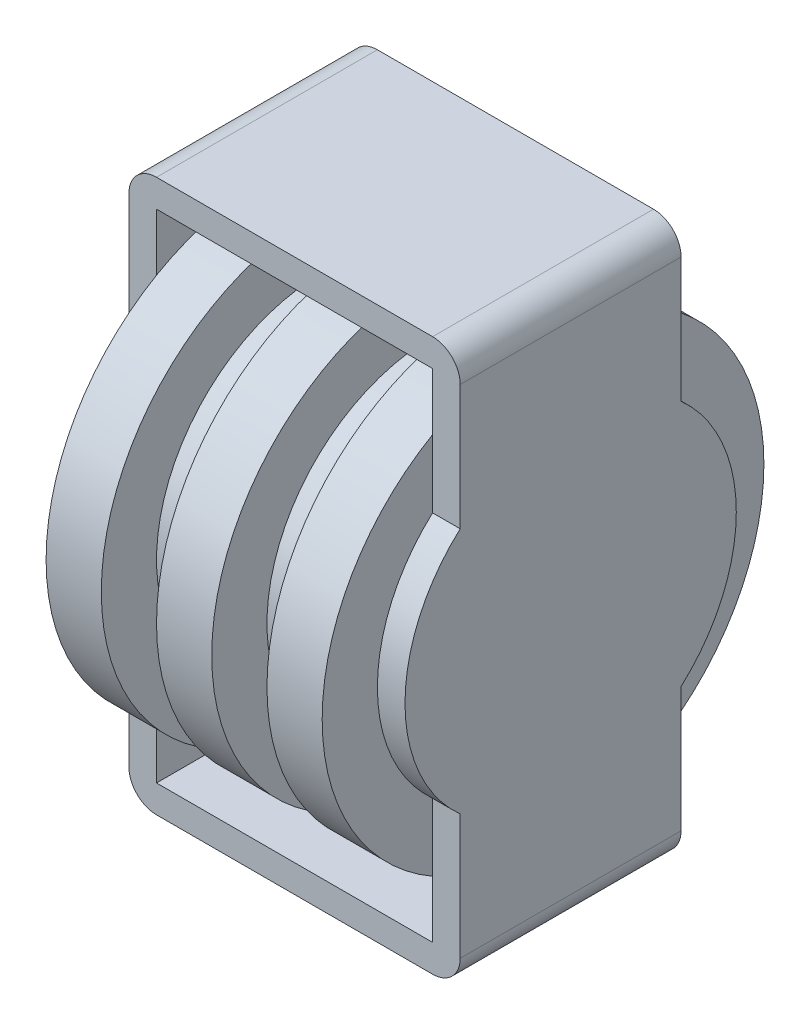
ISO-10303-21;
HEADER;
FILE_DESCRIPTION(('STEP AP214'),'2;1');
FILE_NAME('part.step','',(''),(''),'','','');
FILE_SCHEMA(('AUTOMOTIVE_DESIGN { 1 0 10303 214 1 1 1 1 }'));
ENDSEC;
DATA;
#1=APPLICATION_CONTEXT('core data for automotive mechanical design processes');
#2=APPLICATION_PROTOCOL_DEFINITION('international standard','automotive_design',2000,#1);
#3=PRODUCT_CONTEXT('',#1,'mechanical');
#4=PRODUCT('Part','Part','',(#3));
#5=PRODUCT_RELATED_PRODUCT_CATEGORY('part','',(#4));
#6=PRODUCT_DEFINITION_FORMATION('','',#4);
#7=PRODUCT_DEFINITION_CONTEXT('part definition',#1,'design');
#8=PRODUCT_DEFINITION('design','',#6,#7);
#9=PRODUCT_DEFINITION_SHAPE('','',#8);
#10=(LENGTH_UNIT() NAMED_UNIT(*) SI_UNIT(.MILLI.,.METRE.));
#11=(NAMED_UNIT(*) PLANE_ANGLE_UNIT() SI_UNIT($,.RADIAN.));
#12=(NAMED_UNIT(*) SI_UNIT($,.STERADIAN.) SOLID_ANGLE_UNIT());
#13=UNCERTAINTY_MEASURE_WITH_UNIT(LENGTH_MEASURE(1.E-05),#10,'distance_accuracy_value','');
#14=(GEOMETRIC_REPRESENTATION_CONTEXT(3) GLOBAL_UNCERTAINTY_ASSIGNED_CONTEXT((#13)) GLOBAL_UNIT_ASSIGNED_CONTEXT((#10,
#11,#12)) REPRESENTATION_CONTEXT('',''));
#15=CARTESIAN_POINT('',(0.,0.,0.));
#16=DIRECTION('',(0.,0.,1.));
#17=DIRECTION('',(1.,0.,0.));
#18=AXIS2_PLACEMENT_3D('',#15,#16,#17);
#19=CARTESIAN_POINT('',(2.5,0.,10.));
#20=DIRECTION('',(0.,0.,1.));
#21=DIRECTION('',(1.,0.,0.));
#22=AXIS2_PLACEMENT_3D('',#19,#20,#21);
#23=PLANE('',#22);
#24=DIRECTION('',(0.,-1.,0.));
#25=VECTOR('',#24,1.);
#26=CARTESIAN_POINT('',(30.,-22.5,10.));
#27=LINE('',#26,#25);
#28=CARTESIAN_POINT('',(30.,22.5,10.));
#29=VERTEX_POINT('',#28);
#30=CARTESIAN_POINT('',(30.,11.1803398874989,10.));
#31=VERTEX_POINT('',#30);
#32=EDGE_CURVE('E349',#29,#31,#27,.T.);
#33=ORIENTED_EDGE('',*,*,#32,.F.);
#34=CARTESIAN_POINT('',(27.5,22.5,10.));
#35=DIRECTION('',(0.,0.,1.));
#36=DIRECTION('',(1.,0.,0.));
#37=AXIS2_PLACEMENT_3D('',#34,#35,#36);
#38=CIRCLE('',#37,2.5);
#39=CARTESIAN_POINT('',(27.5,25.,10.));
#40=VERTEX_POINT('',#39);
#41=EDGE_CURVE('E309',#29,#40,#38,.T.);
#42=ORIENTED_EDGE('',*,*,#41,.T.);
#43=DIRECTION('',(1.,0.,0.));
#44=VECTOR('',#43,1.);
#45=CARTESIAN_POINT('',(0.,25.,10.));
#46=LINE('',#45,#44);
#47=CARTESIAN_POINT('',(2.5,25.,10.));
#48=VERTEX_POINT('',#47);
#49=EDGE_CURVE('E423',#48,#40,#46,.T.);
#50=ORIENTED_EDGE('',*,*,#49,.F.);
#51=CARTESIAN_POINT('',(2.5,22.5,10.));
#52=DIRECTION('',(0.,0.,1.));
#53=DIRECTION('',(1.,0.,0.));
#54=AXIS2_PLACEMENT_3D('',#51,#52,#53);
#55=CIRCLE('',#54,2.5);
#56=CARTESIAN_POINT('',(0.,22.5,10.));
#57=VERTEX_POINT('',#56);
#58=EDGE_CURVE('E306',#48,#57,#55,.T.);
#59=ORIENTED_EDGE('',*,*,#58,.T.);
#60=DIRECTION('',(0.,1.,0.));
#61=VECTOR('',#60,1.);
#62=CARTESIAN_POINT('',(0.,0.,10.));
#63=LINE('',#62,#61);
#64=CARTESIAN_POINT('',(0.,11.180339887499,10.));
#65=VERTEX_POINT('',#64);
#66=EDGE_CURVE('E224',#65,#57,#63,.T.);
#67=ORIENTED_EDGE('',*,*,#66,.F.);
#68=DIRECTION('',(-1.,0.,0.));
#69=VECTOR('',#68,1.);
#70=CARTESIAN_POINT('',(2.5,11.180339887499,10.));
#71=LINE('',#70,#69);
#72=CARTESIAN_POINT('',(2.5,11.180339887499,10.));
#73=VERTEX_POINT('',#72);
#74=EDGE_CURVE('E206',#73,#65,#71,.T.);
#75=ORIENTED_EDGE('',*,*,#74,.F.);
#76=DIRECTION('',(0.,1.,0.));
#77=VECTOR('',#76,1.);
#78=CARTESIAN_POINT('',(2.5,0.,10.));
#79=LINE('',#78,#77);
#80=CARTESIAN_POINT('',(2.5,17.3205080756888,10.));
#81=VERTEX_POINT('',#80);
#82=EDGE_CURVE('E221',#73,#81,#79,.T.);
#83=ORIENTED_EDGE('',*,*,#82,.T.);
#84=CARTESIAN_POINT('',(2.5,22.5,10.));
#85=VERTEX_POINT('',#84);
#86=EDGE_CURVE('E235',#81,#85,#79,.T.);
#87=ORIENTED_EDGE('',*,*,#86,.T.);
#88=DIRECTION('',(1.,0.,0.));
#89=VECTOR('',#88,1.);
#90=CARTESIAN_POINT('',(0.,22.5,10.));
#91=LINE('',#90,#89);
#92=CARTESIAN_POINT('',(27.5,22.5,10.));
#93=VERTEX_POINT('',#92);
#94=EDGE_CURVE('E422',#85,#93,#91,.T.);
#95=ORIENTED_EDGE('',*,*,#94,.T.);
#96=DIRECTION('',(0.,-1.,0.));
#97=VECTOR('',#96,1.);
#98=CARTESIAN_POINT('',(27.5,-22.5,10.));
#99=LINE('',#98,#97);
#100=CARTESIAN_POINT('',(27.5,17.3205080756888,10.));
#101=VERTEX_POINT('',#100);
#102=EDGE_CURVE('E443',#93,#101,#99,.T.);
#103=ORIENTED_EDGE('',*,*,#102,.T.);
#104=CARTESIAN_POINT('',(27.5,11.180339887499,10.));
#105=VERTEX_POINT('',#104);
#106=EDGE_CURVE('E216',#101,#105,#99,.T.);
#107=ORIENTED_EDGE('',*,*,#106,.T.);
#108=DIRECTION('',(1.,0.,0.));
#109=VECTOR('',#108,1.);
#110=CARTESIAN_POINT('',(27.5,11.180339887499,10.));
#111=LINE('',#110,#109);
#112=EDGE_CURVE('E403',#31,#105,#111,.F.);
#113=ORIENTED_EDGE('',*,*,#112,.F.);
#114=EDGE_LOOP('',(#33,#42,#50,#59,#67,#75,#83,#87,#95,#103,#107,#113));
#115=FACE_BOUND('',#114,.T.);
#116=ADVANCED_FACE('F41',(#115),#23,.T.);
#117=CARTESIAN_POINT('',(2.5,0.,-10.));
#118=DIRECTION('',(0.,0.,1.));
#119=DIRECTION('',(1.,0.,0.));
#120=AXIS2_PLACEMENT_3D('',#117,#118,#119);
#121=PLANE('',#120);
#122=DIRECTION('',(-1.,0.,0.));
#123=VECTOR('',#122,1.);
#124=CARTESIAN_POINT('',(0.,25.,-10.));
#125=LINE('',#124,#123);
#126=CARTESIAN_POINT('',(27.5,25.,-10.));
#127=VERTEX_POINT('',#126);
#128=CARTESIAN_POINT('',(2.5,25.,-10.));
#129=VERTEX_POINT('',#128);
#130=EDGE_CURVE('E427',#127,#129,#125,.T.);
#131=ORIENTED_EDGE('',*,*,#130,.F.);
#132=CARTESIAN_POINT('',(27.5,22.5,-10.));
#133=DIRECTION('',(0.,0.,1.));
#134=DIRECTION('',(1.,0.,0.));
#135=AXIS2_PLACEMENT_3D('',#132,#133,#134);
#136=CIRCLE('',#135,2.5);
#137=CARTESIAN_POINT('',(30.,22.5,-10.));
#138=VERTEX_POINT('',#137);
#139=EDGE_CURVE('E300',#127,#138,#136,.F.);
#140=ORIENTED_EDGE('',*,*,#139,.T.);
#141=DIRECTION('',(0.,1.,0.));
#142=VECTOR('',#141,1.);
#143=CARTESIAN_POINT('',(30.,-25.,-10.));
#144=LINE('',#143,#142);
#145=CARTESIAN_POINT('',(30.,11.180339887499,-10.));
#146=VERTEX_POINT('',#145);
#147=EDGE_CURVE('E439',#146,#138,#144,.T.);
#148=ORIENTED_EDGE('',*,*,#147,.F.);
#149=DIRECTION('',(1.,0.,0.));
#150=VECTOR('',#149,1.);
#151=CARTESIAN_POINT('',(27.5,11.1803398874989,-10.));
#152=LINE('',#151,#150);
#153=CARTESIAN_POINT('',(27.5,11.180339887499,-10.));
#154=VERTEX_POINT('',#153);
#155=EDGE_CURVE('E396',#146,#154,#152,.F.);
#156=ORIENTED_EDGE('',*,*,#155,.T.);
#157=DIRECTION('',(0.,1.,0.));
#158=VECTOR('',#157,1.);
#159=CARTESIAN_POINT('',(27.5,-22.5,-10.));
#160=LINE('',#159,#158);
#161=CARTESIAN_POINT('',(27.5,17.3205080756888,-10.));
#162=VERTEX_POINT('',#161);
#163=EDGE_CURVE('E452',#154,#162,#160,.T.);
#164=ORIENTED_EDGE('',*,*,#163,.T.);
#165=CARTESIAN_POINT('',(27.5,22.5,-10.));
#166=VERTEX_POINT('',#165);
#167=EDGE_CURVE('E447',#162,#166,#160,.T.);
#168=ORIENTED_EDGE('',*,*,#167,.T.);
#169=DIRECTION('',(-1.,0.,0.));
#170=VECTOR('',#169,1.);
#171=CARTESIAN_POINT('',(0.,22.5,-10.));
#172=LINE('',#171,#170);
#173=CARTESIAN_POINT('',(2.5,22.5,-10.));
#174=VERTEX_POINT('',#173);
#175=EDGE_CURVE('E428',#166,#174,#172,.T.);
#176=ORIENTED_EDGE('',*,*,#175,.T.);
#177=DIRECTION('',(0.,1.,0.));
#178=VECTOR('',#177,1.);
#179=CARTESIAN_POINT('',(2.5,0.,-10.));
#180=LINE('',#179,#178);
#181=CARTESIAN_POINT('',(2.5,17.3205080756888,-10.));
#182=VERTEX_POINT('',#181);
#183=EDGE_CURVE('E244',#182,#174,#180,.T.);
#184=ORIENTED_EDGE('',*,*,#183,.F.);
#185=CARTESIAN_POINT('',(2.5,11.1803398874989,-10.));
#186=VERTEX_POINT('',#185);
#187=EDGE_CURVE('E249',#186,#182,#180,.T.);
#188=ORIENTED_EDGE('',*,*,#187,.F.);
#189=DIRECTION('',(-1.,0.,0.));
#190=VECTOR('',#189,1.);
#191=CARTESIAN_POINT('',(2.5,11.1803398874989,-10.));
#192=LINE('',#191,#190);
#193=CARTESIAN_POINT('',(0.,11.1803398874989,-10.));
#194=VERTEX_POINT('',#193);
#195=EDGE_CURVE('E383',#186,#194,#192,.T.);
#196=ORIENTED_EDGE('',*,*,#195,.T.);
#197=DIRECTION('',(0.,1.,0.));
#198=VECTOR('',#197,1.);
#199=CARTESIAN_POINT('',(0.,0.,-10.));
#200=LINE('',#199,#198);
#201=CARTESIAN_POINT('',(0.,22.5,-10.));
#202=VERTEX_POINT('',#201);
#203=EDGE_CURVE('E284',#194,#202,#200,.T.);
#204=ORIENTED_EDGE('',*,*,#203,.T.);
#205=CARTESIAN_POINT('',(2.5,22.5,-10.));
#206=DIRECTION('',(0.,0.,1.));
#207=DIRECTION('',(1.,0.,0.));
#208=AXIS2_PLACEMENT_3D('',#205,#206,#207);
#209=CIRCLE('',#208,2.5);
#210=EDGE_CURVE('E297',#202,#129,#209,.F.);
#211=ORIENTED_EDGE('',*,*,#210,.T.);
#212=EDGE_LOOP('',(#131,#140,#148,#156,#164,#168,#176,#184,#188,#196,#204,#211));
#213=FACE_BOUND('',#212,.T.);
#214=ADVANCED_FACE('F512',(#213),#121,.F.);
#215=CARTESIAN_POINT('',(2.5,0.,0.));
#216=DIRECTION('',(1.,0.,0.));
#217=DIRECTION('',(0.,0.,-1.));
#218=AXIS2_PLACEMENT_3D('',#215,#216,#217);
#219=PLANE('',#218);
#220=CARTESIAN_POINT('',(2.5,-22.5,10.));
#221=VERTEX_POINT('',#220);
#222=CARTESIAN_POINT('',(2.5,-17.3205080756888,10.));
#223=VERTEX_POINT('',#222);
#224=EDGE_CURVE('E237',#221,#223,#79,.T.);
#225=ORIENTED_EDGE('',*,*,#224,.F.);
#226=DIRECTION('',(0.,0.,1.));
#227=VECTOR('',#226,1.);
#228=CARTESIAN_POINT('',(2.5,-22.5,10.));
#229=LINE('',#228,#227);
#230=CARTESIAN_POINT('',(2.5,-22.5,-10.));
#231=VERTEX_POINT('',#230);
#232=EDGE_CURVE('E409',#231,#221,#229,.T.);
#233=ORIENTED_EDGE('',*,*,#232,.F.);
#234=CARTESIAN_POINT('',(2.5,-17.3205080756888,-10.));
#235=VERTEX_POINT('',#234);
#236=EDGE_CURVE('E257',#231,#235,#180,.T.);
#237=ORIENTED_EDGE('',*,*,#236,.T.);
#238=CARTESIAN_POINT('',(2.5,0.,0.));
#239=DIRECTION('',(1.,0.,0.));
#240=DIRECTION('',(0.,0.,-1.));
#241=AXIS2_PLACEMENT_3D('',#238,#239,#240);
#242=CIRCLE('',#241,20.);
#243=EDGE_CURVE('E288',#223,#235,#242,.T.);
#244=ORIENTED_EDGE('',*,*,#243,.F.);
#245=EDGE_LOOP('',(#225,#233,#237,#244));
#246=FACE_BOUND('',#245,.T.);
#247=ADVANCED_FACE('F503',(#246),#219,.T.);
#248=CARTESIAN_POINT('',(27.5,0.,0.));
#249=DIRECTION('',(1.,0.,0.));
#250=DIRECTION('',(0.,0.,-1.));
#251=AXIS2_PLACEMENT_3D('',#248,#249,#250);
#252=PLANE('',#251);
#253=DIRECTION('',(0.,0.,1.));
#254=VECTOR('',#253,1.);
#255=CARTESIAN_POINT('',(27.5,-22.5,10.));
#256=LINE('',#255,#254);
#257=CARTESIAN_POINT('',(27.5,-22.5,-10.));
#258=VERTEX_POINT('',#257);
#259=CARTESIAN_POINT('',(27.5,-22.5,10.));
#260=VERTEX_POINT('',#259);
#261=EDGE_CURVE('E410',#258,#260,#256,.T.);
#262=ORIENTED_EDGE('',*,*,#261,.T.);
#263=CARTESIAN_POINT('',(27.5,-17.3205080756888,10.));
#264=VERTEX_POINT('',#263);
#265=EDGE_CURVE('E432',#264,#260,#99,.T.);
#266=ORIENTED_EDGE('',*,*,#265,.F.);
#267=CARTESIAN_POINT('',(27.5,0.,0.));
#268=DIRECTION('',(1.,0.,0.));
#269=DIRECTION('',(0.,0.,-1.));
#270=AXIS2_PLACEMENT_3D('',#267,#268,#269);
#271=CIRCLE('',#270,20.);
#272=CARTESIAN_POINT('',(27.5,-17.3205080756888,-9.99999999999999));
#273=VERTEX_POINT('',#272);
#274=EDGE_CURVE('E562',#264,#273,#271,.T.);
#275=ORIENTED_EDGE('',*,*,#274,.T.);
#276=EDGE_CURVE('E449',#258,#273,#160,.T.);
#277=ORIENTED_EDGE('',*,*,#276,.F.);
#278=EDGE_LOOP('',(#262,#266,#275,#277));
#279=FACE_BOUND('',#278,.T.);
#280=ADVANCED_FACE('F575',(#279),#252,.F.);
#281=CARTESIAN_POINT('',(27.5,0.,0.));
#282=DIRECTION('',(1.,0.,0.));
#283=DIRECTION('',(0.,0.,-1.));
#284=AXIS2_PLACEMENT_3D('',#281,#282,#283);
#285=PLANE('',#284);
#286=CARTESIAN_POINT('',(27.5,0.,0.));
#287=DIRECTION('',(1.,0.,0.));
#288=DIRECTION('',(0.,0.,-1.));
#289=AXIS2_PLACEMENT_3D('',#286,#287,#288);
#290=CIRCLE('',#289,15.);
#291=CARTESIAN_POINT('',(27.5,-11.180339887499,10.));
#292=VERTEX_POINT('',#291);
#293=EDGE_CURVE('E392',#105,#292,#290,.T.);
#294=ORIENTED_EDGE('',*,*,#293,.F.);
#295=ORIENTED_EDGE('',*,*,#106,.F.);
#296=EDGE_CURVE('E462',#101,#264,#271,.T.);
#297=ORIENTED_EDGE('',*,*,#296,.T.);
#298=EDGE_CURVE('E448',#292,#264,#99,.T.);
#299=ORIENTED_EDGE('',*,*,#298,.F.);
#300=EDGE_LOOP('',(#294,#295,#297,#299));
#301=FACE_BOUND('',#300,.T.);
#302=ADVANCED_FACE('F539',(#301),#285,.T.);
#303=EDGE_CURVE('E494',#182,#81,#242,.T.);
#304=ORIENTED_EDGE('',*,*,#303,.F.);
#305=ORIENTED_EDGE('',*,*,#183,.T.);
#306=DIRECTION('',(0.,0.,-1.));
#307=VECTOR('',#306,1.);
#308=CARTESIAN_POINT('',(2.5,22.5,0.));
#309=LINE('',#308,#307);
#310=EDGE_CURVE('E266',#85,#174,#309,.T.);
#311=ORIENTED_EDGE('',*,*,#310,.F.);
#312=ORIENTED_EDGE('',*,*,#86,.F.);
#313=EDGE_LOOP('',(#304,#305,#311,#312));
#314=FACE_BOUND('',#313,.T.);
#315=ADVANCED_FACE('F567',(#314),#219,.T.);
#316=DIRECTION('',(-1.,0.,0.));
#317=VECTOR('',#316,1.);
#318=CARTESIAN_POINT('',(2.5,-25.,10.));
#319=LINE('',#318,#317);
#320=CARTESIAN_POINT('',(27.5,-25.,10.));
#321=VERTEX_POINT('',#320);
#322=CARTESIAN_POINT('',(2.5,-25.,10.));
#323=VERTEX_POINT('',#322);
#324=EDGE_CURVE('E278',#321,#323,#319,.T.);
#325=ORIENTED_EDGE('',*,*,#324,.F.);
#326=CARTESIAN_POINT('',(27.5,-22.5,10.));
#327=DIRECTION('',(0.,0.,1.));
#328=DIRECTION('',(1.,0.,0.));
#329=AXIS2_PLACEMENT_3D('',#326,#327,#328);
#330=CIRCLE('',#329,2.5);
#331=CARTESIAN_POINT('',(30.,-22.5,10.));
#332=VERTEX_POINT('',#331);
#333=EDGE_CURVE('E50',#321,#332,#330,.T.);
#334=ORIENTED_EDGE('',*,*,#333,.T.);
#335=CARTESIAN_POINT('',(30.,-11.1803398874989,10.));
#336=VERTEX_POINT('',#335);
#337=EDGE_CURVE('E338',#336,#332,#27,.T.);
#338=ORIENTED_EDGE('',*,*,#337,.F.);
#339=DIRECTION('',(1.,0.,0.));
#340=VECTOR('',#339,1.);
#341=CARTESIAN_POINT('',(27.5,-11.180339887499,10.));
#342=LINE('',#341,#340);
#343=EDGE_CURVE('E406',#292,#336,#342,.T.);
#344=ORIENTED_EDGE('',*,*,#343,.F.);
#345=ORIENTED_EDGE('',*,*,#298,.T.);
#346=ORIENTED_EDGE('',*,*,#265,.T.);
#347=DIRECTION('',(-1.,0.,0.));
#348=VECTOR('',#347,1.);
#349=CARTESIAN_POINT('',(27.5,-22.5,10.));
#350=LINE('',#349,#348);
#351=EDGE_CURVE('E414',#260,#221,#350,.T.);
#352=ORIENTED_EDGE('',*,*,#351,.T.);
#353=ORIENTED_EDGE('',*,*,#224,.T.);
#354=CARTESIAN_POINT('',(2.5,-11.180339887499,10.));
#355=VERTEX_POINT('',#354);
#356=EDGE_CURVE('E234',#223,#355,#79,.T.);
#357=ORIENTED_EDGE('',*,*,#356,.T.);
#358=DIRECTION('',(-1.,0.,0.));
#359=VECTOR('',#358,1.);
#360=CARTESIAN_POINT('',(2.5,-11.180339887499,10.));
#361=LINE('',#360,#359);
#362=CARTESIAN_POINT('',(0.,-11.180339887499,10.));
#363=VERTEX_POINT('',#362);
#364=EDGE_CURVE('E209',#363,#355,#361,.F.);
#365=ORIENTED_EDGE('',*,*,#364,.F.);
#366=CARTESIAN_POINT('',(0.,-22.5,10.));
#367=VERTEX_POINT('',#366);
#368=EDGE_CURVE('E281',#367,#363,#63,.T.);
#369=ORIENTED_EDGE('',*,*,#368,.F.);
#370=CARTESIAN_POINT('',(2.5,-22.5,10.));
#371=DIRECTION('',(0.,0.,1.));
#372=DIRECTION('',(1.,0.,0.));
#373=AXIS2_PLACEMENT_3D('',#370,#371,#372);
#374=CIRCLE('',#373,2.5);
#375=EDGE_CURVE('E57',#367,#323,#374,.T.);
#376=ORIENTED_EDGE('',*,*,#375,.T.);
#377=EDGE_LOOP('',(#325,#334,#338,#344,#345,#346,#352,#353,#357,#365,#369,#376));
#378=FACE_BOUND('',#377,.T.);
#379=ADVANCED_FACE('F336',(#378),#23,.T.);
#380=CARTESIAN_POINT('',(2.5,-25.,0.));
#381=DIRECTION('',(0.,-1.,0.));
#382=DIRECTION('',(0.,0.,-1.));
#383=AXIS2_PLACEMENT_3D('',#380,#381,#382);
#384=PLANE('',#383);
#385=DIRECTION('',(-1.,0.,0.));
#386=VECTOR('',#385,1.);
#387=CARTESIAN_POINT('',(2.5,-25.,-10.));
#388=LINE('',#387,#386);
#389=CARTESIAN_POINT('',(27.5,-25.,-10.));
#390=VERTEX_POINT('',#389);
#391=CARTESIAN_POINT('',(2.5,-25.,-10.));
#392=VERTEX_POINT('',#391);
#393=EDGE_CURVE('E271',#390,#392,#388,.T.);
#394=ORIENTED_EDGE('',*,*,#393,.F.);
#395=DIRECTION('',(0.,0.,-1.));
#396=VECTOR('',#395,1.);
#397=CARTESIAN_POINT('',(27.5,-25.,0.));
#398=LINE('',#397,#396);
#399=EDGE_CURVE('E328',#390,#321,#398,.F.);
#400=ORIENTED_EDGE('',*,*,#399,.T.);
#401=ORIENTED_EDGE('',*,*,#324,.T.);
#402=DIRECTION('',(0.,0.,1.));
#403=VECTOR('',#402,1.);
#404=CARTESIAN_POINT('',(2.5,-25.,-10.));
#405=LINE('',#404,#403);
#406=EDGE_CURVE('E325',#323,#392,#405,.F.);
#407=ORIENTED_EDGE('',*,*,#406,.T.);
#408=EDGE_LOOP('',(#394,#400,#401,#407));
#409=FACE_BOUND('',#408,.T.);
#410=ADVANCED_FACE('F360',(#409),#384,.T.);
#411=CARTESIAN_POINT('',(30.,-22.5,-10.));
#412=VERTEX_POINT('',#411);
#413=CARTESIAN_POINT('',(30.,-11.180339887499,-10.));
#414=VERTEX_POINT('',#413);
#415=EDGE_CURVE('E358',#412,#414,#144,.T.);
#416=ORIENTED_EDGE('',*,*,#415,.F.);
#417=CARTESIAN_POINT('',(27.5,-22.5,-10.));
#418=DIRECTION('',(0.,0.,1.));
#419=DIRECTION('',(1.,0.,0.));
#420=AXIS2_PLACEMENT_3D('',#417,#418,#419);
#421=CIRCLE('',#420,2.5);
#422=EDGE_CURVE('E322',#412,#390,#421,.F.);
#423=ORIENTED_EDGE('',*,*,#422,.T.);
#424=ORIENTED_EDGE('',*,*,#393,.T.);
#425=CARTESIAN_POINT('',(2.5,-22.5,-10.));
#426=DIRECTION('',(0.,0.,1.));
#427=DIRECTION('',(1.,0.,0.));
#428=AXIS2_PLACEMENT_3D('',#425,#426,#427);
#429=CIRCLE('',#428,2.5);
#430=CARTESIAN_POINT('',(0.,-22.5,-10.));
#431=VERTEX_POINT('',#430);
#432=EDGE_CURVE('E319',#392,#431,#429,.F.);
#433=ORIENTED_EDGE('',*,*,#432,.T.);
#434=CARTESIAN_POINT('',(0.,-11.1803398874989,-10.));
#435=VERTEX_POINT('',#434);
#436=EDGE_CURVE('E240',#431,#435,#200,.T.);
#437=ORIENTED_EDGE('',*,*,#436,.T.);
#438=DIRECTION('',(-1.,0.,0.));
#439=VECTOR('',#438,1.);
#440=CARTESIAN_POINT('',(2.5,-11.1803398874989,-10.));
#441=LINE('',#440,#439);
#442=CARTESIAN_POINT('',(2.5,-11.1803398874989,-10.));
#443=VERTEX_POINT('',#442);
#444=EDGE_CURVE('E378',#435,#443,#441,.F.);
#445=ORIENTED_EDGE('',*,*,#444,.T.);
#446=EDGE_CURVE('E250',#235,#443,#180,.T.);
#447=ORIENTED_EDGE('',*,*,#446,.F.);
#448=ORIENTED_EDGE('',*,*,#236,.F.);
#449=DIRECTION('',(-1.,0.,0.));
#450=VECTOR('',#449,1.);
#451=CARTESIAN_POINT('',(27.5,-22.5,-10.));
#452=LINE('',#451,#450);
#453=EDGE_CURVE('E419',#258,#231,#452,.T.);
#454=ORIENTED_EDGE('',*,*,#453,.F.);
#455=ORIENTED_EDGE('',*,*,#276,.T.);
#456=CARTESIAN_POINT('',(27.5,-11.1803398874989,-9.99999999999999));
#457=VERTEX_POINT('',#456);
#458=EDGE_CURVE('E453',#273,#457,#160,.T.);
#459=ORIENTED_EDGE('',*,*,#458,.T.);
#460=DIRECTION('',(1.,0.,0.));
#461=VECTOR('',#460,1.);
#462=CARTESIAN_POINT('',(27.5,-11.1803398874989,-10.));
#463=LINE('',#462,#461);
#464=EDGE_CURVE('E400',#457,#414,#463,.T.);
#465=ORIENTED_EDGE('',*,*,#464,.T.);
#466=EDGE_LOOP('',(#416,#423,#424,#433,#437,#445,#447,#448,#454,#455,#459,#465));
#467=FACE_BOUND('',#466,.T.);
#468=ADVANCED_FACE('F355',(#467),#121,.F.);
#469=CARTESIAN_POINT('',(0.,0.,0.));
#470=DIRECTION('',(1.,0.,0.));
#471=DIRECTION('',(0.,0.,-1.));
#472=AXIS2_PLACEMENT_3D('',#469,#470,#471);
#473=PLANE('',#472);
#474=ORIENTED_EDGE('',*,*,#436,.F.);
#475=DIRECTION('',(0.,0.,1.));
#476=VECTOR('',#475,1.);
#477=CARTESIAN_POINT('',(0.,-22.5,10.));
#478=LINE('',#477,#476);
#479=EDGE_CURVE('E11',#431,#367,#478,.T.);
#480=ORIENTED_EDGE('',*,*,#479,.T.);
#481=ORIENTED_EDGE('',*,*,#368,.T.);
#482=CARTESIAN_POINT('',(0.,0.,0.));
#483=DIRECTION('',(-1.,0.,0.));
#484=DIRECTION('',(0.,0.,1.));
#485=AXIS2_PLACEMENT_3D('',#482,#483,#484);
#486=CIRCLE('',#485,15.);
#487=EDGE_CURVE('E374',#363,#65,#486,.T.);
#488=ORIENTED_EDGE('',*,*,#487,.T.);
#489=ORIENTED_EDGE('',*,*,#66,.T.);
#490=DIRECTION('',(0.,0.,1.));
#491=VECTOR('',#490,1.);
#492=CARTESIAN_POINT('',(0.,22.5,-10.));
#493=LINE('',#492,#491);
#494=EDGE_CURVE('E312',#57,#202,#493,.F.);
#495=ORIENTED_EDGE('',*,*,#494,.T.);
#496=ORIENTED_EDGE('',*,*,#203,.F.);
#497=EDGE_CURVE('E368',#194,#435,#486,.T.);
#498=ORIENTED_EDGE('',*,*,#497,.T.);
#499=EDGE_LOOP('',(#474,#480,#481,#488,#489,#495,#496,#498));
#500=FACE_BOUND('',#499,.T.);
#501=ADVANCED_FACE('F366',(#500),#473,.F.);
#502=CARTESIAN_POINT('',(2.5,0.,0.));
#503=DIRECTION('',(1.,0.,0.));
#504=DIRECTION('',(0.,0.,-1.));
#505=AXIS2_PLACEMENT_3D('',#502,#503,#504);
#506=PLANE('',#505);
#507=ORIENTED_EDGE('',*,*,#446,.T.);
#508=CARTESIAN_POINT('',(2.5,0.,0.));
#509=DIRECTION('',(-1.,0.,0.));
#510=DIRECTION('',(0.,0.,1.));
#511=AXIS2_PLACEMENT_3D('',#508,#509,#510);
#512=CIRCLE('',#511,15.);
#513=EDGE_CURVE('E373',#186,#443,#512,.T.);
#514=ORIENTED_EDGE('',*,*,#513,.F.);
#515=ORIENTED_EDGE('',*,*,#187,.T.);
#516=EDGE_CURVE('E487',#235,#182,#242,.T.);
#517=ORIENTED_EDGE('',*,*,#516,.F.);
#518=EDGE_LOOP('',(#507,#514,#515,#517));
#519=FACE_BOUND('',#518,.T.);
#520=ADVANCED_FACE('F566',(#519),#506,.F.);
#521=CARTESIAN_POINT('',(7.5,0.,0.));
#522=DIRECTION('',(-1.,0.,0.));
#523=DIRECTION('',(0.,0.,1.));
#524=AXIS2_PLACEMENT_3D('',#521,#522,#523);
#525=CYLINDRICAL_SURFACE('',#524,20.);
#526=CARTESIAN_POINT('',(7.5,0.,0.));
#527=DIRECTION('',(1.,0.,0.));
#528=DIRECTION('',(0.,0.,-1.));
#529=AXIS2_PLACEMENT_3D('',#526,#527,#528);
#530=CIRCLE('',#529,20.);
#531=CARTESIAN_POINT('',(7.5,0.,-20.));
#532=VERTEX_POINT('',#531);
#533=EDGE_CURVE('E491',#532,#532,#530,.T.);
#534=ORIENTED_EDGE('',*,*,#533,.F.);
#535=EDGE_LOOP('',(#534));
#536=FACE_BOUND('',#535,.T.);
#537=ORIENTED_EDGE('',*,*,#303,.T.);
#538=EDGE_CURVE('E231',#81,#223,#242,.T.);
#539=ORIENTED_EDGE('',*,*,#538,.T.);
#540=ORIENTED_EDGE('',*,*,#243,.T.);
#541=ORIENTED_EDGE('',*,*,#516,.T.);
#542=EDGE_LOOP('',(#537,#539,#540,#541));
#543=FACE_BOUND('',#542,.T.);
#544=ADVANCED_FACE('F502',(#536,#543),#525,.T.);
#545=CARTESIAN_POINT('',(7.5,0.,0.));
#546=DIRECTION('',(1.,0.,0.));
#547=DIRECTION('',(0.,0.,-1.));
#548=AXIS2_PLACEMENT_3D('',#545,#546,#547);
#549=PLANE('',#548);
#550=CARTESIAN_POINT('',(7.5,0.,0.));
#551=DIRECTION('',(1.,0.,0.));
#552=DIRECTION('',(0.,0.,-1.));
#553=AXIS2_PLACEMENT_3D('',#550,#551,#552);
#554=CIRCLE('',#553,15.);
#555=CARTESIAN_POINT('',(7.5,0.,-15.));
#556=VERTEX_POINT('',#555);
#557=EDGE_CURVE('E475',#556,#556,#554,.T.);
#558=ORIENTED_EDGE('',*,*,#557,.F.);
#559=EDGE_LOOP('',(#558));
#560=FACE_BOUND('',#559,.T.);
#561=ORIENTED_EDGE('',*,*,#533,.T.);
#562=EDGE_LOOP('',(#561));
#563=FACE_BOUND('',#562,.T.);
#564=ADVANCED_FACE('F709',(#560,#563),#549,.T.);
#565=ORIENTED_EDGE('',*,*,#82,.F.);
#566=CARTESIAN_POINT('',(2.5,0.,0.));
#567=DIRECTION('',(1.,0.,0.));
#568=DIRECTION('',(0.,0.,-1.));
#569=AXIS2_PLACEMENT_3D('',#566,#567,#568);
#570=CIRCLE('',#569,15.);
#571=EDGE_CURVE('E202',#73,#355,#570,.T.);
#572=ORIENTED_EDGE('',*,*,#571,.T.);
#573=ORIENTED_EDGE('',*,*,#356,.F.);
#574=ORIENTED_EDGE('',*,*,#538,.F.);
#575=EDGE_LOOP('',(#565,#572,#573,#574));
#576=FACE_BOUND('',#575,.T.);
#577=ADVANCED_FACE('F229',(#576),#506,.F.);
#578=CARTESIAN_POINT('',(12.5,0.,0.));
#579=DIRECTION('',(-1.,0.,0.));
#580=DIRECTION('',(0.,0.,1.));
#581=AXIS2_PLACEMENT_3D('',#578,#579,#580);
#582=CYLINDRICAL_SURFACE('',#581,15.);
#583=CARTESIAN_POINT('',(12.5,0.,0.));
#584=DIRECTION('',(1.,0.,0.));
#585=DIRECTION('',(0.,0.,-1.));
#586=AXIS2_PLACEMENT_3D('',#583,#584,#585);
#587=CIRCLE('',#586,15.);
#588=CARTESIAN_POINT('',(12.5,0.,-15.));
#589=VERTEX_POINT('',#588);
#590=EDGE_CURVE('E480',#589,#589,#587,.T.);
#591=ORIENTED_EDGE('',*,*,#590,.F.);
#592=EDGE_LOOP('',(#591));
#593=FACE_BOUND('',#592,.T.);
#594=ORIENTED_EDGE('',*,*,#557,.T.);
#595=EDGE_LOOP('',(#594));
#596=FACE_BOUND('',#595,.T.);
#597=ADVANCED_FACE('F708',(#593,#596),#582,.T.);
#598=CARTESIAN_POINT('',(17.5,0.,0.));
#599=DIRECTION('',(-1.,0.,0.));
#600=DIRECTION('',(0.,0.,1.));
#601=AXIS2_PLACEMENT_3D('',#598,#599,#600);
#602=CYLINDRICAL_SURFACE('',#601,20.);
#603=CARTESIAN_POINT('',(17.5,0.,0.));
#604=DIRECTION('',(1.,0.,0.));
#605=DIRECTION('',(0.,0.,-1.));
#606=AXIS2_PLACEMENT_3D('',#603,#604,#605);
#607=CIRCLE('',#606,20.);
#608=CARTESIAN_POINT('',(17.5,0.,-20.));
#609=VERTEX_POINT('',#608);
#610=EDGE_CURVE('E476',#609,#609,#607,.T.);
#611=ORIENTED_EDGE('',*,*,#610,.F.);
#612=EDGE_LOOP('',(#611));
#613=FACE_BOUND('',#612,.T.);
#614=CARTESIAN_POINT('',(12.5,0.,0.));
#615=DIRECTION('',(1.,0.,0.));
#616=DIRECTION('',(0.,0.,-1.));
#617=AXIS2_PLACEMENT_3D('',#614,#615,#616);
#618=CIRCLE('',#617,20.);
#619=CARTESIAN_POINT('',(12.5,0.,-20.));
#620=VERTEX_POINT('',#619);
#621=EDGE_CURVE('E470',#620,#620,#618,.T.);
#622=ORIENTED_EDGE('',*,*,#621,.T.);
#623=EDGE_LOOP('',(#622));
#624=FACE_BOUND('',#623,.T.);
#625=ADVANCED_FACE('F832',(#613,#624),#602,.T.);
#626=CARTESIAN_POINT('',(17.5,0.,0.));
#627=DIRECTION('',(1.,0.,0.));
#628=DIRECTION('',(0.,0.,-1.));
#629=AXIS2_PLACEMENT_3D('',#626,#627,#628);
#630=PLANE('',#629);
#631=CARTESIAN_POINT('',(17.5,0.,0.));
#632=DIRECTION('',(1.,0.,0.));
#633=DIRECTION('',(0.,0.,-1.));
#634=AXIS2_PLACEMENT_3D('',#631,#632,#633);
#635=CIRCLE('',#634,15.);
#636=CARTESIAN_POINT('',(17.5,0.,-15.));
#637=VERTEX_POINT('',#636);
#638=EDGE_CURVE('E471',#637,#637,#635,.T.);
#639=ORIENTED_EDGE('',*,*,#638,.F.);
#640=EDGE_LOOP('',(#639));
#641=FACE_BOUND('',#640,.T.);
#642=ORIENTED_EDGE('',*,*,#610,.T.);
#643=EDGE_LOOP('',(#642));
#644=FACE_BOUND('',#643,.T.);
#645=ADVANCED_FACE('F827',(#641,#644),#630,.T.);
#646=CARTESIAN_POINT('',(12.5,0.,0.));
#647=DIRECTION('',(1.,0.,0.));
#648=DIRECTION('',(0.,0.,-1.));
#649=AXIS2_PLACEMENT_3D('',#646,#647,#648);
#650=PLANE('',#649);
#651=ORIENTED_EDGE('',*,*,#590,.T.);
#652=EDGE_LOOP('',(#651));
#653=FACE_BOUND('',#652,.T.);
#654=ORIENTED_EDGE('',*,*,#621,.F.);
#655=EDGE_LOOP('',(#654));
#656=FACE_BOUND('',#655,.T.);
#657=ADVANCED_FACE('F819',(#653,#656),#650,.F.);
#658=CARTESIAN_POINT('',(22.5,0.,0.));
#659=DIRECTION('',(-1.,0.,0.));
#660=DIRECTION('',(0.,0.,1.));
#661=AXIS2_PLACEMENT_3D('',#658,#659,#660);
#662=CYLINDRICAL_SURFACE('',#661,15.);
#663=CARTESIAN_POINT('',(22.5,0.,0.));
#664=DIRECTION('',(1.,0.,0.));
#665=DIRECTION('',(0.,0.,-1.));
#666=AXIS2_PLACEMENT_3D('',#663,#664,#665);
#667=CIRCLE('',#666,15.);
#668=CARTESIAN_POINT('',(22.5,0.,-15.));
#669=VERTEX_POINT('',#668);
#670=EDGE_CURVE('E461',#669,#669,#667,.T.);
#671=ORIENTED_EDGE('',*,*,#670,.F.);
#672=EDGE_LOOP('',(#671));
#673=FACE_BOUND('',#672,.T.);
#674=ORIENTED_EDGE('',*,*,#638,.T.);
#675=EDGE_LOOP('',(#674));
#676=FACE_BOUND('',#675,.T.);
#677=ADVANCED_FACE('F803',(#673,#676),#662,.T.);
#678=CARTESIAN_POINT('',(27.5,0.,0.));
#679=DIRECTION('',(-1.,0.,0.));
#680=DIRECTION('',(0.,0.,1.));
#681=AXIS2_PLACEMENT_3D('',#678,#679,#680);
#682=CYLINDRICAL_SURFACE('',#681,20.);
#683=EDGE_CURVE('E457',#162,#101,#271,.T.);
#684=ORIENTED_EDGE('',*,*,#683,.F.);
#685=EDGE_CURVE('E463',#273,#162,#271,.T.);
#686=ORIENTED_EDGE('',*,*,#685,.F.);
#687=ORIENTED_EDGE('',*,*,#274,.F.);
#688=ORIENTED_EDGE('',*,*,#296,.F.);
#689=EDGE_LOOP('',(#684,#686,#687,#688));
#690=FACE_BOUND('',#689,.T.);
#691=CARTESIAN_POINT('',(22.5,0.,0.));
#692=DIRECTION('',(1.,0.,0.));
#693=DIRECTION('',(0.,0.,-1.));
#694=AXIS2_PLACEMENT_3D('',#691,#692,#693);
#695=CIRCLE('',#694,20.);
#696=CARTESIAN_POINT('',(22.5,0.,-20.));
#697=VERTEX_POINT('',#696);
#698=EDGE_CURVE('E442',#697,#697,#695,.T.);
#699=ORIENTED_EDGE('',*,*,#698,.T.);
#700=EDGE_LOOP('',(#699));
#701=FACE_BOUND('',#700,.T.);
#702=ADVANCED_FACE('F556',(#690,#701),#682,.T.);
#703=EDGE_CURVE('E388',#457,#154,#290,.T.);
#704=ORIENTED_EDGE('',*,*,#703,.F.);
#705=ORIENTED_EDGE('',*,*,#458,.F.);
#706=ORIENTED_EDGE('',*,*,#685,.T.);
#707=ORIENTED_EDGE('',*,*,#163,.F.);
#708=EDGE_LOOP('',(#704,#705,#706,#707));
#709=FACE_BOUND('',#708,.T.);
#710=ADVANCED_FACE('F560',(#709),#285,.T.);
#711=CARTESIAN_POINT('',(22.5,0.,0.));
#712=DIRECTION('',(1.,0.,0.));
#713=DIRECTION('',(0.,0.,-1.));
#714=AXIS2_PLACEMENT_3D('',#711,#712,#713);
#715=PLANE('',#714);
#716=ORIENTED_EDGE('',*,*,#670,.T.);
#717=EDGE_LOOP('',(#716));
#718=FACE_BOUND('',#717,.T.);
#719=ORIENTED_EDGE('',*,*,#698,.F.);
#720=EDGE_LOOP('',(#719));
#721=FACE_BOUND('',#720,.T.);
#722=ADVANCED_FACE('F747',(#718,#721),#715,.F.);
#723=ORIENTED_EDGE('',*,*,#167,.F.);
#724=ORIENTED_EDGE('',*,*,#683,.T.);
#725=ORIENTED_EDGE('',*,*,#102,.F.);
#726=DIRECTION('',(0.,0.,1.));
#727=VECTOR('',#726,1.);
#728=CARTESIAN_POINT('',(27.5,22.5,-10.));
#729=LINE('',#728,#727);
#730=EDGE_CURVE('E350',#166,#93,#729,.T.);
#731=ORIENTED_EDGE('',*,*,#730,.F.);
#732=EDGE_LOOP('',(#723,#724,#725,#731));
#733=FACE_BOUND('',#732,.T.);
#734=ADVANCED_FACE('F563',(#733),#252,.F.);
#735=CARTESIAN_POINT('',(30.,0.,0.));
#736=DIRECTION('',(1.,0.,0.));
#737=DIRECTION('',(0.,0.,-1.));
#738=AXIS2_PLACEMENT_3D('',#735,#736,#737);
#739=PLANE('',#738);
#740=ORIENTED_EDGE('',*,*,#337,.T.);
#741=DIRECTION('',(0.,0.,-1.));
#742=VECTOR('',#741,1.);
#743=CARTESIAN_POINT('',(30.,-22.5,0.));
#744=LINE('',#743,#742);
#745=EDGE_CURVE('E315',#332,#412,#744,.T.);
#746=ORIENTED_EDGE('',*,*,#745,.T.);
#747=ORIENTED_EDGE('',*,*,#415,.T.);
#748=CARTESIAN_POINT('',(30.,0.,0.));
#749=DIRECTION('',(1.,0.,0.));
#750=DIRECTION('',(0.,0.,-1.));
#751=AXIS2_PLACEMENT_3D('',#748,#749,#750);
#752=CIRCLE('',#751,15.);
#753=EDGE_CURVE('E226',#414,#146,#752,.T.);
#754=ORIENTED_EDGE('',*,*,#753,.T.);
#755=ORIENTED_EDGE('',*,*,#147,.T.);
#756=DIRECTION('',(0.,0.,-1.));
#757=VECTOR('',#756,1.);
#758=CARTESIAN_POINT('',(30.,22.5,0.));
#759=LINE('',#758,#757);
#760=EDGE_CURVE('E303',#138,#29,#759,.F.);
#761=ORIENTED_EDGE('',*,*,#760,.T.);
#762=ORIENTED_EDGE('',*,*,#32,.T.);
#763=EDGE_CURVE('E346',#31,#336,#752,.T.);
#764=ORIENTED_EDGE('',*,*,#763,.T.);
#765=EDGE_LOOP('',(#740,#746,#747,#754,#755,#761,#762,#764));
#766=FACE_BOUND('',#765,.T.);
#767=ADVANCED_FACE('F343',(#766),#739,.T.);
#768=CARTESIAN_POINT('',(0.,22.5,0.));
#769=DIRECTION('',(0.,1.,0.));
#770=DIRECTION('',(0.,0.,1.));
#771=AXIS2_PLACEMENT_3D('',#768,#769,#770);
#772=PLANE('',#771);
#773=ORIENTED_EDGE('',*,*,#94,.F.);
#774=ORIENTED_EDGE('',*,*,#310,.T.);
#775=ORIENTED_EDGE('',*,*,#175,.F.);
#776=ORIENTED_EDGE('',*,*,#730,.T.);
#777=EDGE_LOOP('',(#773,#774,#775,#776));
#778=FACE_BOUND('',#777,.T.);
#779=ADVANCED_FACE('F564',(#778),#772,.F.);
#780=CARTESIAN_POINT('',(0.,25.,0.));
#781=DIRECTION('',(0.,1.,0.));
#782=DIRECTION('',(0.,0.,1.));
#783=AXIS2_PLACEMENT_3D('',#780,#781,#782);
#784=PLANE('',#783);
#785=ORIENTED_EDGE('',*,*,#49,.T.);
#786=DIRECTION('',(0.,0.,-1.));
#787=VECTOR('',#786,1.);
#788=CARTESIAN_POINT('',(27.5,25.,0.));
#789=LINE('',#788,#787);
#790=EDGE_CURVE('E293',#40,#127,#789,.T.);
#791=ORIENTED_EDGE('',*,*,#790,.T.);
#792=ORIENTED_EDGE('',*,*,#130,.T.);
#793=DIRECTION('',(0.,0.,1.));
#794=VECTOR('',#793,1.);
#795=CARTESIAN_POINT('',(2.5,25.,10.));
#796=LINE('',#795,#794);
#797=EDGE_CURVE('E215',#129,#48,#796,.T.);
#798=ORIENTED_EDGE('',*,*,#797,.T.);
#799=EDGE_LOOP('',(#785,#791,#792,#798));
#800=FACE_BOUND('',#799,.T.);
#801=ADVANCED_FACE('F514',(#800),#784,.T.);
#802=CARTESIAN_POINT('',(27.5,-22.5,10.));
#803=DIRECTION('',(0.,-1.,0.));
#804=DIRECTION('',(0.,0.,-1.));
#805=AXIS2_PLACEMENT_3D('',#802,#803,#804);
#806=PLANE('',#805);
#807=ORIENTED_EDGE('',*,*,#232,.T.);
#808=ORIENTED_EDGE('',*,*,#351,.F.);
#809=ORIENTED_EDGE('',*,*,#261,.F.);
#810=ORIENTED_EDGE('',*,*,#453,.T.);
#811=EDGE_LOOP('',(#807,#808,#809,#810));
#812=FACE_BOUND('',#811,.T.);
#813=ADVANCED_FACE('F671',(#812),#806,.F.);
#814=CARTESIAN_POINT('',(27.5,0.,0.));
#815=DIRECTION('',(1.,0.,0.));
#816=DIRECTION('',(0.,0.,-1.));
#817=AXIS2_PLACEMENT_3D('',#814,#815,#816);
#818=CYLINDRICAL_SURFACE('',#817,15.);
#819=ORIENTED_EDGE('',*,*,#464,.F.);
#820=ORIENTED_EDGE('',*,*,#703,.T.);
#821=ORIENTED_EDGE('',*,*,#155,.F.);
#822=ORIENTED_EDGE('',*,*,#753,.F.);
#823=EDGE_LOOP('',(#819,#820,#821,#822));
#824=FACE_BOUND('',#823,.T.);
#825=ADVANCED_FACE('F730',(#824),#818,.T.);
#826=ORIENTED_EDGE('',*,*,#293,.T.);
#827=ORIENTED_EDGE('',*,*,#343,.T.);
#828=ORIENTED_EDGE('',*,*,#763,.F.);
#829=ORIENTED_EDGE('',*,*,#112,.T.);
#830=EDGE_LOOP('',(#826,#827,#828,#829));
#831=FACE_BOUND('',#830,.T.);
#832=ADVANCED_FACE('F532',(#831),#818,.T.);
#833=CARTESIAN_POINT('',(2.5,0.,0.));
#834=DIRECTION('',(-1.,0.,0.));
#835=DIRECTION('',(0.,0.,1.));
#836=AXIS2_PLACEMENT_3D('',#833,#834,#835);
#837=CYLINDRICAL_SURFACE('',#836,15.);
#838=ORIENTED_EDGE('',*,*,#571,.F.);
#839=ORIENTED_EDGE('',*,*,#74,.T.);
#840=ORIENTED_EDGE('',*,*,#487,.F.);
#841=ORIENTED_EDGE('',*,*,#364,.T.);
#842=EDGE_LOOP('',(#838,#839,#840,#841));
#843=FACE_BOUND('',#842,.T.);
#844=ADVANCED_FACE('F204',(#843),#837,.T.);
#845=ORIENTED_EDGE('',*,*,#195,.F.);
#846=ORIENTED_EDGE('',*,*,#513,.T.);
#847=ORIENTED_EDGE('',*,*,#444,.F.);
#848=ORIENTED_EDGE('',*,*,#497,.F.);
#849=EDGE_LOOP('',(#845,#846,#847,#848));
#850=FACE_BOUND('',#849,.T.);
#851=ADVANCED_FACE('F589',(#850),#837,.T.);
#852=CARTESIAN_POINT('',(27.5,22.5,0.));
#853=DIRECTION('',(0.,0.,-1.));
#854=DIRECTION('',(-1.,0.,0.));
#855=AXIS2_PLACEMENT_3D('',#852,#853,#854);
#856=CYLINDRICAL_SURFACE('',#855,2.5);
#857=ORIENTED_EDGE('',*,*,#41,.F.);
#858=ORIENTED_EDGE('',*,*,#760,.F.);
#859=ORIENTED_EDGE('',*,*,#139,.F.);
#860=ORIENTED_EDGE('',*,*,#790,.F.);
#861=EDGE_LOOP('',(#857,#858,#859,#860));
#862=FACE_BOUND('',#861,.T.);
#863=ADVANCED_FACE('F519',(#862),#856,.T.);
#864=CARTESIAN_POINT('',(2.5,22.5,0.));
#865=DIRECTION('',(0.,0.,-1.));
#866=DIRECTION('',(-1.,0.,0.));
#867=AXIS2_PLACEMENT_3D('',#864,#865,#866);
#868=CYLINDRICAL_SURFACE('',#867,2.5);
#869=ORIENTED_EDGE('',*,*,#210,.F.);
#870=ORIENTED_EDGE('',*,*,#494,.F.);
#871=ORIENTED_EDGE('',*,*,#58,.F.);
#872=ORIENTED_EDGE('',*,*,#797,.F.);
#873=EDGE_LOOP('',(#869,#870,#871,#872));
#874=FACE_BOUND('',#873,.T.);
#875=ADVANCED_FACE('F508',(#874),#868,.T.);
#876=CARTESIAN_POINT('',(27.5,-22.5,0.));
#877=DIRECTION('',(0.,0.,-1.));
#878=DIRECTION('',(-1.,0.,0.));
#879=AXIS2_PLACEMENT_3D('',#876,#877,#878);
#880=CYLINDRICAL_SURFACE('',#879,2.5);
#881=ORIENTED_EDGE('',*,*,#333,.F.);
#882=ORIENTED_EDGE('',*,*,#399,.F.);
#883=ORIENTED_EDGE('',*,*,#422,.F.);
#884=ORIENTED_EDGE('',*,*,#745,.F.);
#885=EDGE_LOOP('',(#881,#882,#883,#884));
#886=FACE_BOUND('',#885,.T.);
#887=ADVANCED_FACE('F352',(#886),#880,.T.);
#888=CARTESIAN_POINT('',(2.5,-22.5,0.));
#889=DIRECTION('',(0.,0.,-1.));
#890=DIRECTION('',(-1.,0.,0.));
#891=AXIS2_PLACEMENT_3D('',#888,#889,#890);
#892=CYLINDRICAL_SURFACE('',#891,2.5);
#893=ORIENTED_EDGE('',*,*,#432,.F.);
#894=ORIENTED_EDGE('',*,*,#406,.F.);
#895=ORIENTED_EDGE('',*,*,#375,.F.);
#896=ORIENTED_EDGE('',*,*,#479,.F.);
#897=EDGE_LOOP('',(#893,#894,#895,#896));
#898=FACE_BOUND('',#897,.T.);
#899=ADVANCED_FACE('F43',(#898),#892,.T.);
#900=CLOSED_SHELL('',(#116,#214,#247,#280,#302,#315,#379,#410,#468,#501,#520,#544,#564,#577,
#597,#625,#645,#657,#677,#702,#710,#722,#734,#767,#779,#801,#813,#825,#832,#844,#851,#863,#875,
#887,#899));
#901=MANIFOLD_SOLID_BREP('B2',#900);
#902=ADVANCED_BREP_SHAPE_REPRESENTATION('',(#18,#901),#14);
#903=SHAPE_DEFINITION_REPRESENTATION(#9,#902);
ENDSEC;
END-ISO-10303-21;
